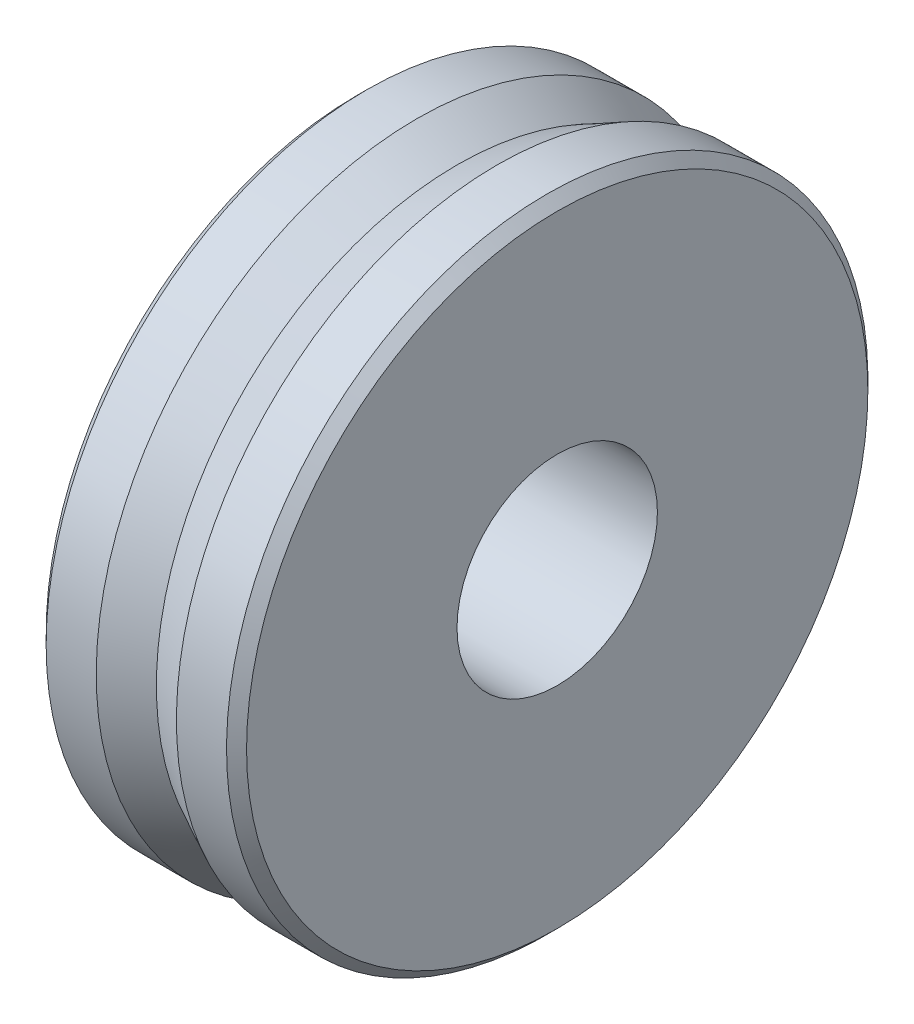
ISO-10303-21;
HEADER;
FILE_DESCRIPTION(('STEP AP214'),'2;1');
FILE_NAME('part.step','',(''),(''),'','','');
FILE_SCHEMA(('AUTOMOTIVE_DESIGN { 1 0 10303 214 1 1 1 1 }'));
ENDSEC;
DATA;
#1=APPLICATION_CONTEXT('core data for automotive mechanical design processes');
#2=APPLICATION_PROTOCOL_DEFINITION('international standard','automotive_design',2000,#1);
#3=PRODUCT_CONTEXT('',#1,'mechanical');
#4=PRODUCT('Part','Part','',(#3));
#5=PRODUCT_RELATED_PRODUCT_CATEGORY('part','',(#4));
#6=PRODUCT_DEFINITION_FORMATION('','',#4);
#7=PRODUCT_DEFINITION_CONTEXT('part definition',#1,'design');
#8=PRODUCT_DEFINITION('design','',#6,#7);
#9=PRODUCT_DEFINITION_SHAPE('','',#8);
#10=(LENGTH_UNIT() NAMED_UNIT(*) SI_UNIT(.MILLI.,.METRE.));
#11=(NAMED_UNIT(*) PLANE_ANGLE_UNIT() SI_UNIT($,.RADIAN.));
#12=(NAMED_UNIT(*) SI_UNIT($,.STERADIAN.) SOLID_ANGLE_UNIT());
#13=UNCERTAINTY_MEASURE_WITH_UNIT(LENGTH_MEASURE(1.E-05),#10,'distance_accuracy_value','');
#14=(GEOMETRIC_REPRESENTATION_CONTEXT(3) GLOBAL_UNCERTAINTY_ASSIGNED_CONTEXT((#13)) GLOBAL_UNIT_ASSIGNED_CONTEXT((#10,
#11,#12)) REPRESENTATION_CONTEXT('',''));
#15=CARTESIAN_POINT('',(0.,0.,0.));
#16=DIRECTION('',(0.,0.,1.));
#17=DIRECTION('',(1.,0.,0.));
#18=AXIS2_PLACEMENT_3D('',#15,#16,#17);
#19=CARTESIAN_POINT('',(2.375,0.,0.));
#20=DIRECTION('',(-1.,0.,0.));
#21=DIRECTION('',(0.,1.,0.));
#22=AXIS2_PLACEMENT_3D('',#19,#20,#21);
#23=CONICAL_SURFACE('',#22,7.875,0.785398163397449);
#24=CARTESIAN_POINT('',(2.25,0.,0.));
#25=DIRECTION('',(1.,0.,0.));
#26=DIRECTION('',(0.,1.,0.));
#27=AXIS2_PLACEMENT_3D('',#24,#25,#26);
#28=CIRCLE('',#27,8.);
#29=CARTESIAN_POINT('',(2.25,8.,0.));
#30=VERTEX_POINT('',#29);
#31=EDGE_CURVE('E10',#30,#30,#28,.T.);
#32=ORIENTED_EDGE('',*,*,#31,.T.);
#33=EDGE_LOOP('',(#32));
#34=FACE_BOUND('',#33,.T.);
#35=CARTESIAN_POINT('',(2.5,0.,0.));
#36=DIRECTION('',(-1.,0.,0.));
#37=DIRECTION('',(0.,0.,1.));
#38=AXIS2_PLACEMENT_3D('',#35,#36,#37);
#39=CIRCLE('',#38,7.75);
#40=CARTESIAN_POINT('',(2.5,0.,7.75));
#41=VERTEX_POINT('',#40);
#42=EDGE_CURVE('E22',#41,#41,#39,.T.);
#43=ORIENTED_EDGE('',*,*,#42,.T.);
#44=EDGE_LOOP('',(#43));
#45=FACE_BOUND('',#44,.T.);
#46=ADVANCED_FACE('F14',(#34,#45),#23,.T.);
#47=CARTESIAN_POINT('',(1.75,0.,0.));
#48=DIRECTION('',(1.,0.,0.));
#49=DIRECTION('',(0.,1.,0.));
#50=AXIS2_PLACEMENT_3D('',#47,#48,#49);
#51=CYLINDRICAL_SURFACE('',#50,8.);
#52=CARTESIAN_POINT('',(1.,0.,0.));
#53=DIRECTION('',(1.,0.,0.));
#54=DIRECTION('',(0.,1.,0.));
#55=AXIS2_PLACEMENT_3D('',#52,#53,#54);
#56=CIRCLE('',#55,8.);
#57=CARTESIAN_POINT('',(1.,8.,0.));
#58=VERTEX_POINT('',#57);
#59=EDGE_CURVE('E27',#58,#58,#56,.T.);
#60=ORIENTED_EDGE('',*,*,#59,.T.);
#61=EDGE_LOOP('',(#60));
#62=FACE_BOUND('',#61,.T.);
#63=ORIENTED_EDGE('',*,*,#31,.F.);
#64=EDGE_LOOP('',(#63));
#65=FACE_BOUND('',#64,.T.);
#66=ADVANCED_FACE('F65',(#62,#65),#51,.T.);
#67=CARTESIAN_POINT('',(2.5,5.25,0.));
#68=DIRECTION('',(1.,0.,0.));
#69=DIRECTION('',(0.,0.,-1.));
#70=AXIS2_PLACEMENT_3D('',#67,#68,#69);
#71=PLANE('',#70);
#72=CARTESIAN_POINT('',(2.5,0.,0.));
#73=DIRECTION('',(1.,0.,0.));
#74=DIRECTION('',(0.,1.,0.));
#75=AXIS2_PLACEMENT_3D('',#72,#73,#74);
#76=CIRCLE('',#75,2.5);
#77=CARTESIAN_POINT('',(2.5,2.5,0.));
#78=VERTEX_POINT('',#77);
#79=EDGE_CURVE('E33',#78,#78,#76,.T.);
#80=ORIENTED_EDGE('',*,*,#79,.F.);
#81=EDGE_LOOP('',(#80));
#82=FACE_BOUND('',#81,.T.);
#83=ORIENTED_EDGE('',*,*,#42,.F.);
#84=EDGE_LOOP('',(#83));
#85=FACE_BOUND('',#84,.T.);
#86=ADVANCED_FACE('F70',(#82,#85),#71,.T.);
#87=CARTESIAN_POINT('',(-2.375,0.,0.));
#88=DIRECTION('',(1.,0.,0.));
#89=DIRECTION('',(0.,1.,0.));
#90=AXIS2_PLACEMENT_3D('',#87,#88,#89);
#91=CONICAL_SURFACE('',#90,7.875,0.785398163397449);
#92=CARTESIAN_POINT('',(-2.5,0.,0.));
#93=DIRECTION('',(1.,0.,0.));
#94=DIRECTION('',(0.,1.,0.));
#95=AXIS2_PLACEMENT_3D('',#92,#93,#94);
#96=CIRCLE('',#95,7.75);
#97=CARTESIAN_POINT('',(-2.5,7.75,0.));
#98=VERTEX_POINT('',#97);
#99=EDGE_CURVE('E32',#98,#98,#96,.T.);
#100=ORIENTED_EDGE('',*,*,#99,.T.);
#101=EDGE_LOOP('',(#100));
#102=FACE_BOUND('',#101,.T.);
#103=CARTESIAN_POINT('',(-2.25,0.,0.));
#104=DIRECTION('',(-1.,0.,0.));
#105=DIRECTION('',(0.,0.,1.));
#106=AXIS2_PLACEMENT_3D('',#103,#104,#105);
#107=CIRCLE('',#106,8.);
#108=CARTESIAN_POINT('',(-2.25,0.,8.));
#109=VERTEX_POINT('',#108);
#110=EDGE_CURVE('E38',#109,#109,#107,.T.);
#111=ORIENTED_EDGE('',*,*,#110,.T.);
#112=EDGE_LOOP('',(#111));
#113=FACE_BOUND('',#112,.T.);
#114=ADVANCED_FACE('F75',(#102,#113),#91,.T.);
#115=CARTESIAN_POINT('',(-2.5,5.25,0.));
#116=DIRECTION('',(-1.,0.,0.));
#117=DIRECTION('',(0.,0.,1.));
#118=AXIS2_PLACEMENT_3D('',#115,#116,#117);
#119=PLANE('',#118);
#120=CARTESIAN_POINT('',(-2.5,0.,0.));
#121=DIRECTION('',(1.,0.,0.));
#122=DIRECTION('',(0.,1.,0.));
#123=AXIS2_PLACEMENT_3D('',#120,#121,#122);
#124=CIRCLE('',#123,2.5);
#125=CARTESIAN_POINT('',(-2.5,2.5,0.));
#126=VERTEX_POINT('',#125);
#127=EDGE_CURVE('E41',#126,#126,#124,.T.);
#128=ORIENTED_EDGE('',*,*,#127,.T.);
#129=EDGE_LOOP('',(#128));
#130=FACE_BOUND('',#129,.T.);
#131=ORIENTED_EDGE('',*,*,#99,.F.);
#132=EDGE_LOOP('',(#131));
#133=FACE_BOUND('',#132,.T.);
#134=ADVANCED_FACE('F61',(#130,#133),#119,.T.);
#135=CARTESIAN_POINT('',(-1.75,0.,0.));
#136=DIRECTION('',(1.,0.,0.));
#137=DIRECTION('',(0.,1.,0.));
#138=AXIS2_PLACEMENT_3D('',#135,#136,#137);
#139=CYLINDRICAL_SURFACE('',#138,8.);
#140=CARTESIAN_POINT('',(-1.,0.,0.));
#141=DIRECTION('',(1.,0.,0.));
#142=DIRECTION('',(0.,1.,0.));
#143=AXIS2_PLACEMENT_3D('',#140,#141,#142);
#144=CIRCLE('',#143,8.);
#145=CARTESIAN_POINT('',(-1.,8.,0.));
#146=VERTEX_POINT('',#145);
#147=EDGE_CURVE('E43',#146,#146,#144,.T.);
#148=ORIENTED_EDGE('',*,*,#147,.F.);
#149=EDGE_LOOP('',(#148));
#150=FACE_BOUND('',#149,.T.);
#151=ORIENTED_EDGE('',*,*,#110,.F.);
#152=EDGE_LOOP('',(#151));
#153=FACE_BOUND('',#152,.T.);
#154=ADVANCED_FACE('F53',(#150,#153),#139,.T.);
#155=CARTESIAN_POINT('',(-0.5,0.,0.));
#156=DIRECTION('',(-1.,0.,0.));
#157=DIRECTION('',(0.,1.,0.));
#158=AXIS2_PLACEMENT_3D('',#155,#156,#157);
#159=CONICAL_SURFACE('',#158,7.75,0.463647609000806);
#160=CARTESIAN_POINT('',(0.,0.,0.));
#161=DIRECTION('',(1.,0.,0.));
#162=DIRECTION('',(0.,1.,0.));
#163=AXIS2_PLACEMENT_3D('',#160,#161,#162);
#164=CIRCLE('',#163,7.5);
#165=CARTESIAN_POINT('',(0.,7.5,0.));
#166=VERTEX_POINT('',#165);
#167=EDGE_CURVE('E18',#166,#166,#164,.T.);
#168=ORIENTED_EDGE('',*,*,#167,.F.);
#169=EDGE_LOOP('',(#168));
#170=FACE_BOUND('',#169,.T.);
#171=ORIENTED_EDGE('',*,*,#147,.T.);
#172=EDGE_LOOP('',(#171));
#173=FACE_BOUND('',#172,.T.);
#174=ADVANCED_FACE('F16',(#170,#173),#159,.T.);
#175=CARTESIAN_POINT('',(0.5,0.,0.));
#176=DIRECTION('',(1.,0.,0.));
#177=DIRECTION('',(0.,1.,0.));
#178=AXIS2_PLACEMENT_3D('',#175,#176,#177);
#179=CONICAL_SURFACE('',#178,7.75,0.463647609000806);
#180=ORIENTED_EDGE('',*,*,#59,.F.);
#181=EDGE_LOOP('',(#180));
#182=FACE_BOUND('',#181,.T.);
#183=ORIENTED_EDGE('',*,*,#167,.T.);
#184=EDGE_LOOP('',(#183));
#185=FACE_BOUND('',#184,.T.);
#186=ADVANCED_FACE('F50',(#182,#185),#179,.T.);
#187=CARTESIAN_POINT('',(0.,0.,0.));
#188=DIRECTION('',(1.,0.,0.));
#189=DIRECTION('',(0.,1.,0.));
#190=AXIS2_PLACEMENT_3D('',#187,#188,#189);
#191=CYLINDRICAL_SURFACE('',#190,2.5);
#192=ORIENTED_EDGE('',*,*,#127,.F.);
#193=EDGE_LOOP('',(#192));
#194=FACE_BOUND('',#193,.T.);
#195=ORIENTED_EDGE('',*,*,#79,.T.);
#196=EDGE_LOOP('',(#195));
#197=FACE_BOUND('',#196,.T.);
#198=ADVANCED_FACE('F59',(#194,#197),#191,.F.);
#199=CLOSED_SHELL('',(#46,#66,#86,#114,#134,#154,#174,#186,#198));
#200=MANIFOLD_SOLID_BREP('B1',#199);
#201=ADVANCED_BREP_SHAPE_REPRESENTATION('',(#18,#200),#14);
#202=SHAPE_DEFINITION_REPRESENTATION(#9,#201);
ENDSEC;
END-ISO-10303-21;
